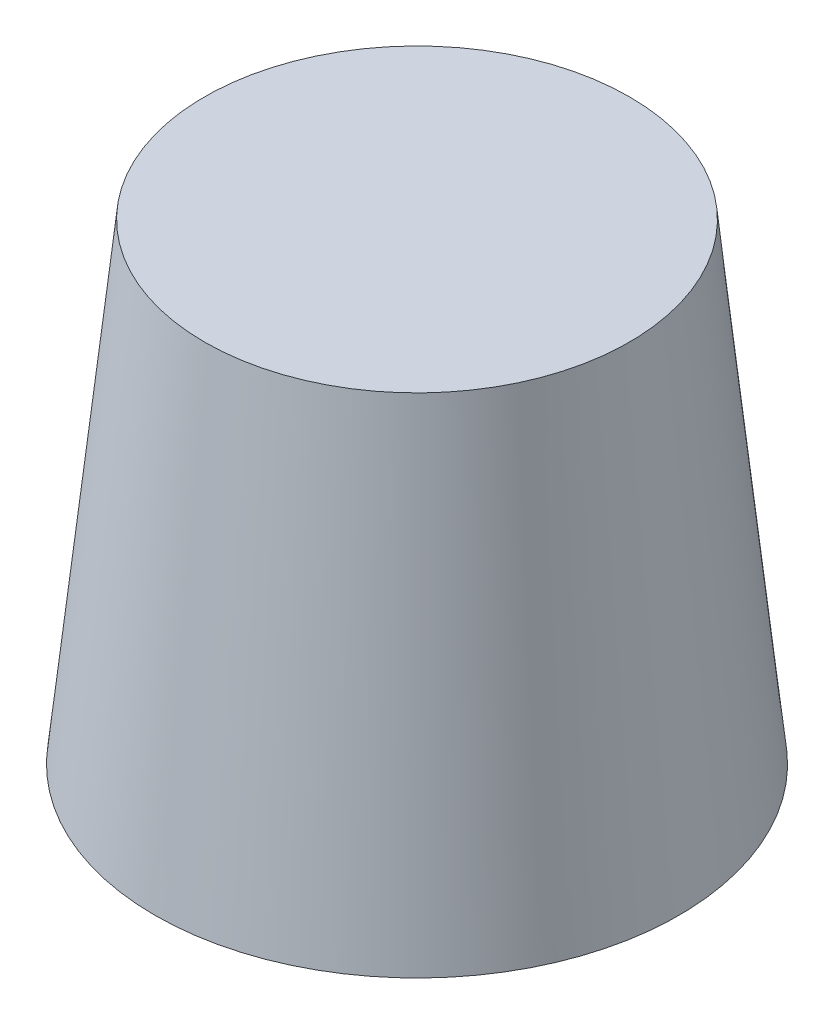
ISO-10303-21;
HEADER;
FILE_DESCRIPTION(('STEP AP214'),'2;1');
FILE_NAME('part.step','',(''),(''),'','','');
FILE_SCHEMA(('AUTOMOTIVE_DESIGN { 1 0 10303 214 1 1 1 1 }'));
ENDSEC;
DATA;
#1=APPLICATION_CONTEXT('core data for automotive mechanical design processes');
#2=APPLICATION_PROTOCOL_DEFINITION('international standard','automotive_design',2000,#1);
#3=PRODUCT_CONTEXT('',#1,'mechanical');
#4=PRODUCT('Part','Part','',(#3));
#5=PRODUCT_RELATED_PRODUCT_CATEGORY('part','',(#4));
#6=PRODUCT_DEFINITION_FORMATION('','',#4);
#7=PRODUCT_DEFINITION_CONTEXT('part definition',#1,'design');
#8=PRODUCT_DEFINITION('design','',#6,#7);
#9=PRODUCT_DEFINITION_SHAPE('','',#8);
#10=(LENGTH_UNIT() NAMED_UNIT(*) SI_UNIT(.MILLI.,.METRE.));
#11=(NAMED_UNIT(*) PLANE_ANGLE_UNIT() SI_UNIT($,.RADIAN.));
#12=(NAMED_UNIT(*) SI_UNIT($,.STERADIAN.) SOLID_ANGLE_UNIT());
#13=UNCERTAINTY_MEASURE_WITH_UNIT(LENGTH_MEASURE(1.E-05),#10,'distance_accuracy_value','');
#14=(GEOMETRIC_REPRESENTATION_CONTEXT(3) GLOBAL_UNCERTAINTY_ASSIGNED_CONTEXT((#13)) GLOBAL_UNIT_ASSIGNED_CONTEXT((#10,
#11,#12)) REPRESENTATION_CONTEXT('',''));
#15=CARTESIAN_POINT('',(0.,0.,0.));
#16=DIRECTION('',(0.,0.,1.));
#17=DIRECTION('',(1.,0.,0.));
#18=AXIS2_PLACEMENT_3D('',#15,#16,#17);
#19=CARTESIAN_POINT('',(0.,0.,0.));
#20=DIRECTION('',(0.,-1.,0.));
#21=DIRECTION('',(0.,0.,1.));
#22=AXIS2_PLACEMENT_3D('',#19,#20,#21);
#23=CONICAL_SURFACE('',#22,5.,0.10471975511966);
#24=CARTESIAN_POINT('',(0.,9.,0.));
#25=DIRECTION('',(0.,1.,0.));
#26=DIRECTION('',(0.,0.,1.));
#27=AXIS2_PLACEMENT_3D('',#24,#25,#26);
#28=CIRCLE('',#27,4.05406188260891);
#29=CARTESIAN_POINT('',(0.,9.,4.05406188260891));
#30=VERTEX_POINT('',#29);
#31=EDGE_CURVE('E11',#30,#30,#28,.T.);
#32=ORIENTED_EDGE('',*,*,#31,.F.);
#33=EDGE_LOOP('',(#32));
#34=FACE_BOUND('',#33,.T.);
#35=CARTESIAN_POINT('',(0.,0.,0.));
#36=DIRECTION('',(0.,1.,0.));
#37=DIRECTION('',(0.,0.,1.));
#38=AXIS2_PLACEMENT_3D('',#35,#36,#37);
#39=CIRCLE('',#38,5.);
#40=CARTESIAN_POINT('',(0.,0.,5.));
#41=VERTEX_POINT('',#40);
#42=EDGE_CURVE('E46',#41,#41,#39,.T.);
#43=ORIENTED_EDGE('',*,*,#42,.T.);
#44=EDGE_LOOP('',(#43));
#45=FACE_BOUND('',#44,.T.);
#46=ADVANCED_FACE('F39',(#34,#45),#23,.T.);
#47=CARTESIAN_POINT('',(0.,9.,0.));
#48=DIRECTION('',(0.,1.,0.));
#49=DIRECTION('',(0.,0.,1.));
#50=AXIS2_PLACEMENT_3D('',#47,#48,#49);
#51=PLANE('',#50);
#52=ORIENTED_EDGE('',*,*,#31,.T.);
#53=EDGE_LOOP('',(#52));
#54=FACE_BOUND('',#53,.T.);
#55=ADVANCED_FACE('F122',(#54),#51,.T.);
#56=CARTESIAN_POINT('',(0.,0.,0.));
#57=DIRECTION('',(0.,1.,0.));
#58=DIRECTION('',(0.,0.,1.));
#59=AXIS2_PLACEMENT_3D('',#56,#57,#58);
#60=PLANE('',#59);
#61=DIRECTION('',(1.,0.,0.));
#62=VECTOR('',#61,1.);
#63=CARTESIAN_POINT('',(-1.2,0.,-2.7));
#64=LINE('',#63,#62);
#65=CARTESIAN_POINT('',(-1.2,0.,-2.7));
#66=VERTEX_POINT('',#65);
#67=CARTESIAN_POINT('',(1.2,0.,-2.7));
#68=VERTEX_POINT('',#67);
#69=EDGE_CURVE('E88',#66,#68,#64,.T.);
#70=ORIENTED_EDGE('',*,*,#69,.F.);
#71=DIRECTION('',(0.,0.,-1.));
#72=VECTOR('',#71,1.);
#73=CARTESIAN_POINT('',(-1.2,0.,-2.7));
#74=LINE('',#73,#72);
#75=CARTESIAN_POINT('',(-1.2,0.,2.7));
#76=VERTEX_POINT('',#75);
#77=EDGE_CURVE('E53',#76,#66,#74,.T.);
#78=ORIENTED_EDGE('',*,*,#77,.F.);
#79=DIRECTION('',(-1.,0.,0.));
#80=VECTOR('',#79,1.);
#81=CARTESIAN_POINT('',(-1.2,0.,2.7));
#82=LINE('',#81,#80);
#83=CARTESIAN_POINT('',(1.2,0.,2.7));
#84=VERTEX_POINT('',#83);
#85=EDGE_CURVE('E104',#84,#76,#82,.T.);
#86=ORIENTED_EDGE('',*,*,#85,.F.);
#87=DIRECTION('',(0.,0.,1.));
#88=VECTOR('',#87,1.);
#89=CARTESIAN_POINT('',(1.2,0.,-2.7));
#90=LINE('',#89,#88);
#91=EDGE_CURVE('E110',#68,#84,#90,.T.);
#92=ORIENTED_EDGE('',*,*,#91,.F.);
#93=EDGE_LOOP('',(#70,#78,#86,#92));
#94=FACE_BOUND('',#93,.T.);
#95=ORIENTED_EDGE('',*,*,#42,.F.);
#96=EDGE_LOOP('',(#95));
#97=FACE_BOUND('',#96,.T.);
#98=ADVANCED_FACE('F119',(#94,#97),#60,.F.);
#99=CARTESIAN_POINT('',(-1.2,7.,-2.7));
#100=DIRECTION('',(-1.,0.,0.));
#101=DIRECTION('',(0.,0.,1.));
#102=AXIS2_PLACEMENT_3D('',#99,#100,#101);
#103=PLANE('',#102);
#104=ORIENTED_EDGE('',*,*,#77,.T.);
#105=DIRECTION('',(0.,-1.,0.));
#106=VECTOR('',#105,1.);
#107=CARTESIAN_POINT('',(-1.2,7.,-2.7));
#108=LINE('',#107,#106);
#109=CARTESIAN_POINT('',(-1.2,7.,-2.7));
#110=VERTEX_POINT('',#109);
#111=EDGE_CURVE('E76',#110,#66,#108,.T.);
#112=ORIENTED_EDGE('',*,*,#111,.F.);
#113=DIRECTION('',(0.,0.,-1.));
#114=VECTOR('',#113,1.);
#115=CARTESIAN_POINT('',(-1.2,7.,-2.7));
#116=LINE('',#115,#114);
#117=CARTESIAN_POINT('',(-1.2,7.,2.7));
#118=VERTEX_POINT('',#117);
#119=EDGE_CURVE('E102',#118,#110,#116,.T.);
#120=ORIENTED_EDGE('',*,*,#119,.F.);
#121=DIRECTION('',(0.,-1.,0.));
#122=VECTOR('',#121,1.);
#123=CARTESIAN_POINT('',(-1.2,7.,2.7));
#124=LINE('',#123,#122);
#125=EDGE_CURVE('E61',#118,#76,#124,.T.);
#126=ORIENTED_EDGE('',*,*,#125,.T.);
#127=EDGE_LOOP('',(#104,#112,#120,#126));
#128=FACE_BOUND('',#127,.T.);
#129=ADVANCED_FACE('F121',(#128),#103,.F.);
#130=CARTESIAN_POINT('',(-1.2,7.,2.7));
#131=DIRECTION('',(0.,0.,1.));
#132=DIRECTION('',(1.,0.,0.));
#133=AXIS2_PLACEMENT_3D('',#130,#131,#132);
#134=PLANE('',#133);
#135=ORIENTED_EDGE('',*,*,#85,.T.);
#136=ORIENTED_EDGE('',*,*,#125,.F.);
#137=DIRECTION('',(-1.,0.,0.));
#138=VECTOR('',#137,1.);
#139=CARTESIAN_POINT('',(-1.2,7.,2.7));
#140=LINE('',#139,#138);
#141=CARTESIAN_POINT('',(1.2,7.,2.7));
#142=VERTEX_POINT('',#141);
#143=EDGE_CURVE('E99',#142,#118,#140,.T.);
#144=ORIENTED_EDGE('',*,*,#143,.F.);
#145=DIRECTION('',(0.,-1.,0.));
#146=VECTOR('',#145,1.);
#147=CARTESIAN_POINT('',(1.2,7.,2.7));
#148=LINE('',#147,#146);
#149=EDGE_CURVE('E92',#142,#84,#148,.T.);
#150=ORIENTED_EDGE('',*,*,#149,.T.);
#151=EDGE_LOOP('',(#135,#136,#144,#150));
#152=FACE_BOUND('',#151,.T.);
#153=ADVANCED_FACE('F128',(#152),#134,.F.);
#154=CARTESIAN_POINT('',(1.2,7.,-2.7));
#155=DIRECTION('',(1.,0.,0.));
#156=DIRECTION('',(0.,0.,-1.));
#157=AXIS2_PLACEMENT_3D('',#154,#155,#156);
#158=PLANE('',#157);
#159=ORIENTED_EDGE('',*,*,#91,.T.);
#160=ORIENTED_EDGE('',*,*,#149,.F.);
#161=DIRECTION('',(0.,0.,1.));
#162=VECTOR('',#161,1.);
#163=CARTESIAN_POINT('',(1.2,7.,-2.7));
#164=LINE('',#163,#162);
#165=CARTESIAN_POINT('',(1.2,7.,-2.7));
#166=VERTEX_POINT('',#165);
#167=EDGE_CURVE('E95',#166,#142,#164,.T.);
#168=ORIENTED_EDGE('',*,*,#167,.F.);
#169=DIRECTION('',(0.,-1.,0.));
#170=VECTOR('',#169,1.);
#171=CARTESIAN_POINT('',(1.2,7.,-2.7));
#172=LINE('',#171,#170);
#173=EDGE_CURVE('E81',#166,#68,#172,.T.);
#174=ORIENTED_EDGE('',*,*,#173,.T.);
#175=EDGE_LOOP('',(#159,#160,#168,#174));
#176=FACE_BOUND('',#175,.T.);
#177=ADVANCED_FACE('F96',(#176),#158,.F.);
#178=CARTESIAN_POINT('',(-1.2,7.,-2.7));
#179=DIRECTION('',(0.,0.,-1.));
#180=DIRECTION('',(-1.,0.,0.));
#181=AXIS2_PLACEMENT_3D('',#178,#179,#180);
#182=PLANE('',#181);
#183=ORIENTED_EDGE('',*,*,#69,.T.);
#184=ORIENTED_EDGE('',*,*,#173,.F.);
#185=DIRECTION('',(1.,0.,0.));
#186=VECTOR('',#185,1.);
#187=CARTESIAN_POINT('',(-1.2,7.,-2.7));
#188=LINE('',#187,#186);
#189=EDGE_CURVE('E85',#110,#166,#188,.T.);
#190=ORIENTED_EDGE('',*,*,#189,.F.);
#191=ORIENTED_EDGE('',*,*,#111,.T.);
#192=EDGE_LOOP('',(#183,#184,#190,#191));
#193=FACE_BOUND('',#192,.T.);
#194=ADVANCED_FACE('F83',(#193),#182,.F.);
#195=CARTESIAN_POINT('',(0.,7.,0.));
#196=DIRECTION('',(0.,1.,0.));
#197=DIRECTION('',(0.,0.,1.));
#198=AXIS2_PLACEMENT_3D('',#195,#196,#197);
#199=PLANE('',#198);
#200=ORIENTED_EDGE('',*,*,#119,.T.);
#201=ORIENTED_EDGE('',*,*,#189,.T.);
#202=ORIENTED_EDGE('',*,*,#167,.T.);
#203=ORIENTED_EDGE('',*,*,#143,.T.);
#204=EDGE_LOOP('',(#200,#201,#202,#203));
#205=FACE_BOUND('',#204,.T.);
#206=ADVANCED_FACE('F101',(#205),#199,.F.);
#207=CLOSED_SHELL('',(#46,#55,#98,#129,#153,#177,#194,#206));
#208=MANIFOLD_SOLID_BREP('B2',#207);
#209=ADVANCED_BREP_SHAPE_REPRESENTATION('',(#18,#208),#14);
#210=SHAPE_DEFINITION_REPRESENTATION(#9,#209);
ENDSEC;
END-ISO-10303-21;
